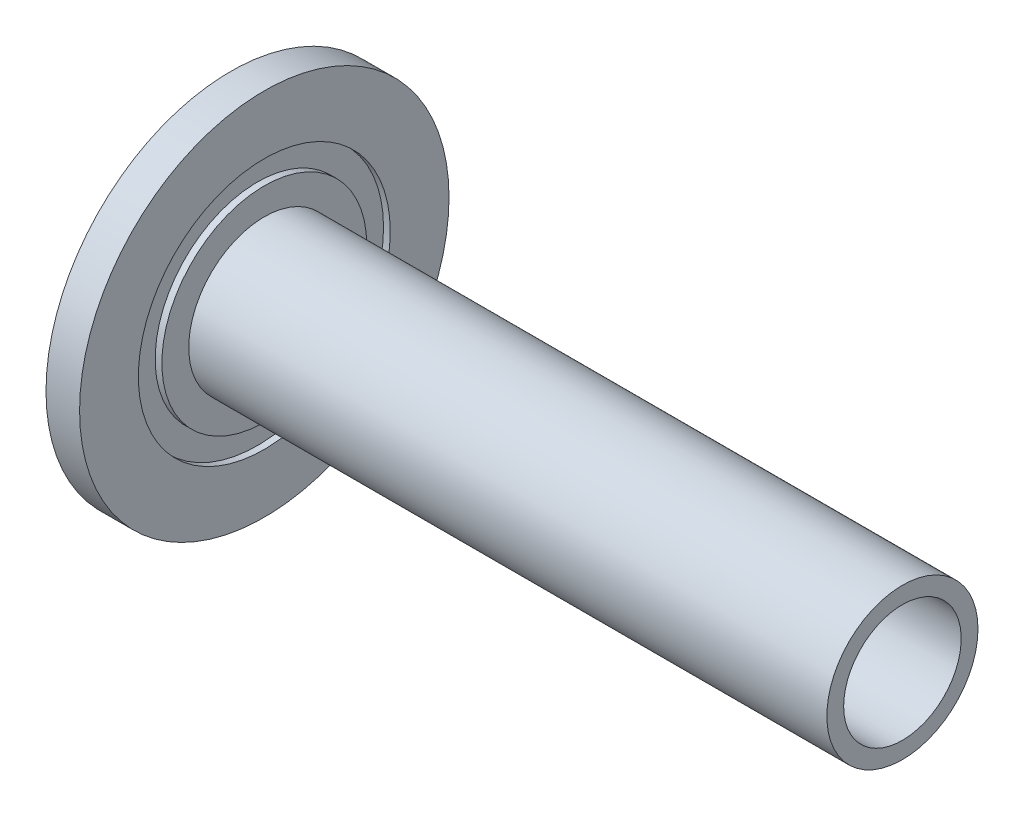
ISO-10303-21;
HEADER;
FILE_DESCRIPTION(('STEP AP214'),'2;1');
FILE_NAME('part.step','',(''),(''),'','','');
FILE_SCHEMA(('AUTOMOTIVE_DESIGN { 1 0 10303 214 1 1 1 1 }'));
ENDSEC;
DATA;
#1=APPLICATION_CONTEXT('core data for automotive mechanical design processes');
#2=APPLICATION_PROTOCOL_DEFINITION('international standard','automotive_design',2000,#1);
#3=PRODUCT_CONTEXT('',#1,'mechanical');
#4=PRODUCT('Part','Part','',(#3));
#5=PRODUCT_RELATED_PRODUCT_CATEGORY('part','',(#4));
#6=PRODUCT_DEFINITION_FORMATION('','',#4);
#7=PRODUCT_DEFINITION_CONTEXT('part definition',#1,'design');
#8=PRODUCT_DEFINITION('design','',#6,#7);
#9=PRODUCT_DEFINITION_SHAPE('','',#8);
#10=(LENGTH_UNIT() NAMED_UNIT(*) SI_UNIT(.MILLI.,.METRE.));
#11=(NAMED_UNIT(*) PLANE_ANGLE_UNIT() SI_UNIT($,.RADIAN.));
#12=(NAMED_UNIT(*) SI_UNIT($,.STERADIAN.) SOLID_ANGLE_UNIT());
#13=UNCERTAINTY_MEASURE_WITH_UNIT(LENGTH_MEASURE(1.E-05),#10,'distance_accuracy_value','');
#14=(GEOMETRIC_REPRESENTATION_CONTEXT(3) GLOBAL_UNCERTAINTY_ASSIGNED_CONTEXT((#13)) GLOBAL_UNIT_ASSIGNED_CONTEXT((#10,
#11,#12)) REPRESENTATION_CONTEXT('',''));
#15=CARTESIAN_POINT('',(0.,0.,0.));
#16=DIRECTION('',(0.,0.,1.));
#17=DIRECTION('',(1.,0.,0.));
#18=AXIS2_PLACEMENT_3D('',#15,#16,#17);
#19=CARTESIAN_POINT('',(1.,0.,0.));
#20=DIRECTION('',(-1.,0.,0.));
#21=DIRECTION('',(0.,0.,1.));
#22=AXIS2_PLACEMENT_3D('',#19,#20,#21);
#23=CYLINDRICAL_SURFACE('',#22,37.5);
#24=CARTESIAN_POINT('',(1.,0.,0.));
#25=DIRECTION('',(-1.,0.,0.));
#26=DIRECTION('',(0.,0.,1.));
#27=AXIS2_PLACEMENT_3D('',#24,#25,#26);
#28=CIRCLE('',#27,37.5);
#29=CARTESIAN_POINT('',(1.,-37.3125,3.74530956664458));
#30=VERTEX_POINT('',#29);
#31=CARTESIAN_POINT('',(1.,37.3125,3.74530956664458));
#32=VERTEX_POINT('',#31);
#33=EDGE_CURVE('E127',#30,#32,#28,.T.);
#34=ORIENTED_EDGE('',*,*,#33,.F.);
#35=DIRECTION('',(-1.,0.,0.));
#36=VECTOR('',#35,1.);
#37=CARTESIAN_POINT('',(1.,-37.3125,3.74530956664462));
#38=LINE('',#37,#36);
#39=CARTESIAN_POINT('',(0.,-37.3125,3.74530956664465));
#40=VERTEX_POINT('',#39);
#41=EDGE_CURVE('E124',#30,#40,#38,.T.);
#42=ORIENTED_EDGE('',*,*,#41,.T.);
#43=CARTESIAN_POINT('',(0.,0.,0.));
#44=DIRECTION('',(-1.,0.,0.));
#45=DIRECTION('',(0.,0.,1.));
#46=AXIS2_PLACEMENT_3D('',#43,#44,#45);
#47=CIRCLE('',#46,37.5);
#48=CARTESIAN_POINT('',(0.,37.3125,3.74530956664465));
#49=VERTEX_POINT('',#48);
#50=EDGE_CURVE('E118',#40,#49,#47,.T.);
#51=ORIENTED_EDGE('',*,*,#50,.T.);
#52=DIRECTION('',(-1.,0.,0.));
#53=VECTOR('',#52,1.);
#54=CARTESIAN_POINT('',(1.,37.3125,3.74530956664462));
#55=LINE('',#54,#53);
#56=EDGE_CURVE('E99',#49,#32,#55,.F.);
#57=ORIENTED_EDGE('',*,*,#56,.T.);
#58=EDGE_LOOP('',(#34,#42,#51,#57));
#59=FACE_BOUND('',#58,.T.);
#60=ADVANCED_FACE('F37',(#59),#23,.F.);
#61=CARTESIAN_POINT('',(1.,0.,0.));
#62=DIRECTION('',(-1.,0.,0.));
#63=DIRECTION('',(0.,0.,1.));
#64=AXIS2_PLACEMENT_3D('',#61,#62,#63);
#65=PLANE('',#64);
#66=CARTESIAN_POINT('',(1.,-34.,0.));
#67=DIRECTION('',(-1.,0.,0.));
#68=DIRECTION('',(0.,0.,1.));
#69=AXIS2_PLACEMENT_3D('',#66,#67,#68);
#70=CIRCLE('',#69,5.);
#71=CARTESIAN_POINT('',(1.,-30.3125,-3.37673566481002));
#72=VERTEX_POINT('',#71);
#73=CARTESIAN_POINT('',(1.,-37.3125,-3.74530956664458));
#74=VERTEX_POINT('',#73);
#75=EDGE_CURVE('E165',#72,#74,#70,.T.);
#76=ORIENTED_EDGE('',*,*,#75,.F.);
#77=CARTESIAN_POINT('',(1.,0.,0.));
#78=DIRECTION('',(-1.,0.,0.));
#79=DIRECTION('',(0.,0.,1.));
#80=AXIS2_PLACEMENT_3D('',#77,#78,#79);
#81=CIRCLE('',#80,30.5);
#82=CARTESIAN_POINT('',(1.,30.3125,-3.37673566481002));
#83=VERTEX_POINT('',#82);
#84=EDGE_CURVE('E125',#83,#72,#81,.T.);
#85=ORIENTED_EDGE('',*,*,#84,.F.);
#86=CARTESIAN_POINT('',(1.,34.,0.));
#87=DIRECTION('',(-1.,0.,0.));
#88=DIRECTION('',(0.,0.,1.));
#89=AXIS2_PLACEMENT_3D('',#86,#87,#88);
#90=CIRCLE('',#89,5.);
#91=CARTESIAN_POINT('',(1.,37.3125,-3.74530956664458));
#92=VERTEX_POINT('',#91);
#93=EDGE_CURVE('E110',#92,#83,#90,.T.);
#94=ORIENTED_EDGE('',*,*,#93,.F.);
#95=EDGE_CURVE('E138',#92,#74,#28,.T.);
#96=ORIENTED_EDGE('',*,*,#95,.T.);
#97=EDGE_LOOP('',(#76,#85,#94,#96));
#98=FACE_BOUND('',#97,.T.);
#99=ADVANCED_FACE('F173',(#98),#65,.T.);
#100=CARTESIAN_POINT('',(1.,0.,0.));
#101=DIRECTION('',(-1.,0.,0.));
#102=DIRECTION('',(0.,0.,1.));
#103=AXIS2_PLACEMENT_3D('',#100,#101,#102);
#104=CYLINDRICAL_SURFACE('',#103,30.5);
#105=DIRECTION('',(-1.,0.,0.));
#106=VECTOR('',#105,1.);
#107=CARTESIAN_POINT('',(1.,-30.3125,3.37673566481002));
#108=LINE('',#107,#106);
#109=CARTESIAN_POINT('',(1.,-30.3125,3.37673566481));
#110=VERTEX_POINT('',#109);
#111=CARTESIAN_POINT('',(0.,-30.3125,3.37673566481002));
#112=VERTEX_POINT('',#111);
#113=EDGE_CURVE('E11',#110,#112,#108,.T.);
#114=ORIENTED_EDGE('',*,*,#113,.F.);
#115=CARTESIAN_POINT('',(1.,30.3125,3.37673566481002));
#116=VERTEX_POINT('',#115);
#117=EDGE_CURVE('E129',#110,#116,#81,.T.);
#118=ORIENTED_EDGE('',*,*,#117,.T.);
#119=DIRECTION('',(-1.,0.,0.));
#120=VECTOR('',#119,1.);
#121=CARTESIAN_POINT('',(1.,30.3125,3.37673566481002));
#122=LINE('',#121,#120);
#123=CARTESIAN_POINT('',(0.,30.3125,3.37673566481002));
#124=VERTEX_POINT('',#123);
#125=EDGE_CURVE('E148',#124,#116,#122,.F.);
#126=ORIENTED_EDGE('',*,*,#125,.F.);
#127=CARTESIAN_POINT('',(0.,0.,0.));
#128=DIRECTION('',(-1.,0.,0.));
#129=DIRECTION('',(0.,0.,1.));
#130=AXIS2_PLACEMENT_3D('',#127,#128,#129);
#131=CIRCLE('',#130,30.5);
#132=EDGE_CURVE('E187',#112,#124,#131,.T.);
#133=ORIENTED_EDGE('',*,*,#132,.F.);
#134=EDGE_LOOP('',(#114,#118,#126,#133));
#135=FACE_BOUND('',#134,.T.);
#136=ADVANCED_FACE('F219',(#135),#104,.T.);
#137=CARTESIAN_POINT('',(10.,0.,0.));
#138=DIRECTION('',(1.,0.,0.));
#139=DIRECTION('',(0.,0.,-1.));
#140=AXIS2_PLACEMENT_3D('',#137,#138,#139);
#141=PLANE('',#140);
#142=CARTESIAN_POINT('',(10.,0.,0.));
#143=DIRECTION('',(1.,0.,0.));
#144=DIRECTION('',(0.,0.,-1.));
#145=AXIS2_PLACEMENT_3D('',#142,#143,#144);
#146=CIRCLE('',#145,22.5);
#147=CARTESIAN_POINT('',(10.,0.,-22.5));
#148=VERTEX_POINT('',#147);
#149=EDGE_CURVE('E145',#148,#148,#146,.T.);
#150=ORIENTED_EDGE('',*,*,#149,.F.);
#151=EDGE_LOOP('',(#150));
#152=FACE_BOUND('',#151,.T.);
#153=CARTESIAN_POINT('',(10.,0.,0.));
#154=DIRECTION('',(1.,0.,0.));
#155=DIRECTION('',(0.,0.,-1.));
#156=AXIS2_PLACEMENT_3D('',#153,#154,#155);
#157=CIRCLE('',#156,30.5);
#158=CARTESIAN_POINT('',(10.,0.,-30.5));
#159=VERTEX_POINT('',#158);
#160=EDGE_CURVE('E202',#159,#159,#157,.T.);
#161=ORIENTED_EDGE('',*,*,#160,.T.);
#162=EDGE_LOOP('',(#161));
#163=FACE_BOUND('',#162,.T.);
#164=ADVANCED_FACE('F273',(#152,#163),#141,.T.);
#165=CARTESIAN_POINT('',(0.,0.,0.));
#166=DIRECTION('',(1.,0.,0.));
#167=DIRECTION('',(0.,0.,-1.));
#168=AXIS2_PLACEMENT_3D('',#165,#166,#167);
#169=PLANE('',#168);
#170=CARTESIAN_POINT('',(0.,0.,0.));
#171=DIRECTION('',(1.,0.,0.));
#172=DIRECTION('',(0.,0.,-1.));
#173=AXIS2_PLACEMENT_3D('',#170,#171,#172);
#174=CIRCLE('',#173,17.5);
#175=CARTESIAN_POINT('',(0.,0.,-17.5));
#176=VERTEX_POINT('',#175);
#177=EDGE_CURVE('E137',#176,#176,#174,.T.);
#178=ORIENTED_EDGE('',*,*,#177,.T.);
#179=EDGE_LOOP('',(#178));
#180=FACE_BOUND('',#179,.T.);
#181=CARTESIAN_POINT('',(0.,30.3125,-3.37673566481002));
#182=VERTEX_POINT('',#181);
#183=CARTESIAN_POINT('',(0.,-30.3125,-3.37673566481002));
#184=VERTEX_POINT('',#183);
#185=EDGE_CURVE('E182',#182,#184,#131,.T.);
#186=ORIENTED_EDGE('',*,*,#185,.T.);
#187=CARTESIAN_POINT('',(0.,-34.,0.));
#188=DIRECTION('',(-1.,0.,0.));
#189=DIRECTION('',(0.,0.,1.));
#190=AXIS2_PLACEMENT_3D('',#187,#188,#189);
#191=CIRCLE('',#190,5.);
#192=EDGE_CURVE('E51',#112,#184,#191,.T.);
#193=ORIENTED_EDGE('',*,*,#192,.F.);
#194=ORIENTED_EDGE('',*,*,#132,.T.);
#195=CARTESIAN_POINT('',(0.,34.,0.));
#196=DIRECTION('',(-1.,0.,0.));
#197=DIRECTION('',(0.,0.,1.));
#198=AXIS2_PLACEMENT_3D('',#195,#196,#197);
#199=CIRCLE('',#198,5.);
#200=EDGE_CURVE('E59',#182,#124,#199,.T.);
#201=ORIENTED_EDGE('',*,*,#200,.F.);
#202=EDGE_LOOP('',(#186,#193,#194,#201));
#203=FACE_BOUND('',#202,.T.);
#204=ADVANCED_FACE('F185',(#180,#203),#169,.F.);
#205=CARTESIAN_POINT('',(10.,0.,0.));
#206=DIRECTION('',(-1.,0.,0.));
#207=DIRECTION('',(0.,0.,1.));
#208=AXIS2_PLACEMENT_3D('',#205,#206,#207);
#209=CYLINDRICAL_SURFACE('',#208,55.);
#210=CARTESIAN_POINT('',(10.,0.,0.));
#211=DIRECTION('',(1.,0.,0.));
#212=DIRECTION('',(0.,0.,-1.));
#213=AXIS2_PLACEMENT_3D('',#210,#211,#212);
#214=CIRCLE('',#213,55.);
#215=CARTESIAN_POINT('',(10.,0.,-55.));
#216=VERTEX_POINT('',#215);
#217=EDGE_CURVE('E149',#216,#216,#214,.T.);
#218=ORIENTED_EDGE('',*,*,#217,.F.);
#219=EDGE_LOOP('',(#218));
#220=FACE_BOUND('',#219,.T.);
#221=CARTESIAN_POINT('',(0.,0.,0.));
#222=DIRECTION('',(1.,0.,0.));
#223=DIRECTION('',(0.,0.,-1.));
#224=AXIS2_PLACEMENT_3D('',#221,#222,#223);
#225=CIRCLE('',#224,55.);
#226=CARTESIAN_POINT('',(0.,0.,-55.));
#227=VERTEX_POINT('',#226);
#228=EDGE_CURVE('E144',#227,#227,#225,.T.);
#229=ORIENTED_EDGE('',*,*,#228,.T.);
#230=EDGE_LOOP('',(#229));
#231=FACE_BOUND('',#230,.T.);
#232=ADVANCED_FACE('F39',(#220,#231),#209,.T.);
#233=CARTESIAN_POINT('',(10.,0.,0.));
#234=DIRECTION('',(1.,0.,0.));
#235=DIRECTION('',(0.,0.,-1.));
#236=AXIS2_PLACEMENT_3D('',#233,#234,#235);
#237=CIRCLE('',#236,37.5);
#238=CARTESIAN_POINT('',(10.,0.,-37.5));
#239=VERTEX_POINT('',#238);
#240=EDGE_CURVE('E208',#239,#239,#237,.T.);
#241=ORIENTED_EDGE('',*,*,#240,.F.);
#242=EDGE_LOOP('',(#241));
#243=FACE_BOUND('',#242,.T.);
#244=ORIENTED_EDGE('',*,*,#217,.T.);
#245=EDGE_LOOP('',(#244));
#246=FACE_BOUND('',#245,.T.);
#247=ADVANCED_FACE('F270',(#243,#246),#141,.T.);
#248=ORIENTED_EDGE('',*,*,#50,.F.);
#249=CARTESIAN_POINT('',(0.,-37.3125,-3.74530956664465));
#250=VERTEX_POINT('',#249);
#251=EDGE_CURVE('E121',#250,#40,#191,.T.);
#252=ORIENTED_EDGE('',*,*,#251,.F.);
#253=CARTESIAN_POINT('',(0.,37.3125,-3.74530956664465));
#254=VERTEX_POINT('',#253);
#255=EDGE_CURVE('E120',#254,#250,#47,.T.);
#256=ORIENTED_EDGE('',*,*,#255,.F.);
#257=EDGE_CURVE('E102',#49,#254,#199,.T.);
#258=ORIENTED_EDGE('',*,*,#257,.F.);
#259=EDGE_LOOP('',(#248,#252,#256,#258));
#260=FACE_BOUND('',#259,.T.);
#261=ORIENTED_EDGE('',*,*,#228,.F.);
#262=EDGE_LOOP('',(#261));
#263=FACE_BOUND('',#262,.T.);
#264=ADVANCED_FACE('F115',(#260,#263),#169,.F.);
#265=CARTESIAN_POINT('',(200.,0.,0.));
#266=DIRECTION('',(-1.,0.,0.));
#267=DIRECTION('',(0.,0.,1.));
#268=AXIS2_PLACEMENT_3D('',#265,#266,#267);
#269=CYLINDRICAL_SURFACE('',#268,22.5);
#270=CARTESIAN_POINT('',(200.,0.,0.));
#271=DIRECTION('',(1.,0.,0.));
#272=DIRECTION('',(0.,0.,-1.));
#273=AXIS2_PLACEMENT_3D('',#270,#271,#272);
#274=CIRCLE('',#273,22.5);
#275=CARTESIAN_POINT('',(200.,0.,-22.5));
#276=VERTEX_POINT('',#275);
#277=EDGE_CURVE('E141',#276,#276,#274,.T.);
#278=ORIENTED_EDGE('',*,*,#277,.F.);
#279=EDGE_LOOP('',(#278));
#280=FACE_BOUND('',#279,.T.);
#281=ORIENTED_EDGE('',*,*,#149,.T.);
#282=EDGE_LOOP('',(#281));
#283=FACE_BOUND('',#282,.T.);
#284=ADVANCED_FACE('F261',(#280,#283),#269,.T.);
#285=CARTESIAN_POINT('',(200.,0.,0.));
#286=DIRECTION('',(1.,0.,0.));
#287=DIRECTION('',(0.,0.,-1.));
#288=AXIS2_PLACEMENT_3D('',#285,#286,#287);
#289=PLANE('',#288);
#290=CARTESIAN_POINT('',(200.,0.,0.));
#291=DIRECTION('',(-1.,0.,0.));
#292=DIRECTION('',(0.,0.,1.));
#293=AXIS2_PLACEMENT_3D('',#290,#291,#292);
#294=CIRCLE('',#293,17.5);
#295=CARTESIAN_POINT('',(200.,0.,17.5));
#296=VERTEX_POINT('',#295);
#297=EDGE_CURVE('E134',#296,#296,#294,.T.);
#298=ORIENTED_EDGE('',*,*,#297,.T.);
#299=EDGE_LOOP('',(#298));
#300=FACE_BOUND('',#299,.T.);
#301=ORIENTED_EDGE('',*,*,#277,.T.);
#302=EDGE_LOOP('',(#301));
#303=FACE_BOUND('',#302,.T.);
#304=ADVANCED_FACE('F256',(#300,#303),#289,.T.);
#305=CARTESIAN_POINT('',(200.,0.,0.));
#306=DIRECTION('',(-1.,0.,0.));
#307=DIRECTION('',(0.,0.,1.));
#308=AXIS2_PLACEMENT_3D('',#305,#306,#307);
#309=CYLINDRICAL_SURFACE('',#308,17.5);
#310=ORIENTED_EDGE('',*,*,#297,.F.);
#311=EDGE_LOOP('',(#310));
#312=FACE_BOUND('',#311,.T.);
#313=ORIENTED_EDGE('',*,*,#177,.F.);
#314=EDGE_LOOP('',(#313));
#315=FACE_BOUND('',#314,.T.);
#316=ADVANCED_FACE('F250',(#312,#315),#309,.F.);
#317=ORIENTED_EDGE('',*,*,#255,.T.);
#318=DIRECTION('',(-1.,0.,0.));
#319=VECTOR('',#318,1.);
#320=CARTESIAN_POINT('',(1.,-37.3125,-3.74530956664462));
#321=LINE('',#320,#319);
#322=EDGE_CURVE('E176',#250,#74,#321,.F.);
#323=ORIENTED_EDGE('',*,*,#322,.T.);
#324=ORIENTED_EDGE('',*,*,#95,.F.);
#325=DIRECTION('',(-1.,0.,0.));
#326=VECTOR('',#325,1.);
#327=CARTESIAN_POINT('',(1.,37.3125,-3.74530956664462));
#328=LINE('',#327,#326);
#329=EDGE_CURVE('E177',#92,#254,#328,.T.);
#330=ORIENTED_EDGE('',*,*,#329,.T.);
#331=EDGE_LOOP('',(#317,#323,#324,#330));
#332=FACE_BOUND('',#331,.T.);
#333=ADVANCED_FACE('F243',(#332),#23,.F.);
#334=EDGE_CURVE('E179',#30,#110,#70,.T.);
#335=ORIENTED_EDGE('',*,*,#334,.F.);
#336=ORIENTED_EDGE('',*,*,#33,.T.);
#337=EDGE_CURVE('E105',#116,#32,#90,.T.);
#338=ORIENTED_EDGE('',*,*,#337,.F.);
#339=ORIENTED_EDGE('',*,*,#117,.F.);
#340=EDGE_LOOP('',(#335,#336,#338,#339));
#341=FACE_BOUND('',#340,.T.);
#342=ADVANCED_FACE('F222',(#341),#65,.T.);
#343=DIRECTION('',(-1.,0.,0.));
#344=VECTOR('',#343,1.);
#345=CARTESIAN_POINT('',(1.,-30.3125,-3.37673566481002));
#346=LINE('',#345,#344);
#347=EDGE_CURVE('E45',#184,#72,#346,.F.);
#348=ORIENTED_EDGE('',*,*,#347,.F.);
#349=ORIENTED_EDGE('',*,*,#185,.F.);
#350=DIRECTION('',(-1.,0.,0.));
#351=VECTOR('',#350,1.);
#352=CARTESIAN_POINT('',(1.,30.3125,-3.37673566481002));
#353=LINE('',#352,#351);
#354=EDGE_CURVE('E162',#83,#182,#353,.T.);
#355=ORIENTED_EDGE('',*,*,#354,.F.);
#356=ORIENTED_EDGE('',*,*,#84,.T.);
#357=EDGE_LOOP('',(#348,#349,#355,#356));
#358=FACE_BOUND('',#357,.T.);
#359=ADVANCED_FACE('F181',(#358),#104,.T.);
#360=CARTESIAN_POINT('',(8.,0.,0.));
#361=DIRECTION('',(1.,0.,0.));
#362=DIRECTION('',(0.,0.,-1.));
#363=AXIS2_PLACEMENT_3D('',#360,#361,#362);
#364=CYLINDRICAL_SURFACE('',#363,37.5);
#365=CARTESIAN_POINT('',(8.,0.,0.));
#366=DIRECTION('',(1.,0.,0.));
#367=DIRECTION('',(0.,0.,-1.));
#368=AXIS2_PLACEMENT_3D('',#365,#366,#367);
#369=CIRCLE('',#368,37.5);
#370=CARTESIAN_POINT('',(8.,0.,-37.5));
#371=VERTEX_POINT('',#370);
#372=EDGE_CURVE('E211',#371,#371,#369,.T.);
#373=ORIENTED_EDGE('',*,*,#372,.F.);
#374=EDGE_LOOP('',(#373));
#375=FACE_BOUND('',#374,.T.);
#376=ORIENTED_EDGE('',*,*,#240,.T.);
#377=EDGE_LOOP('',(#376));
#378=FACE_BOUND('',#377,.T.);
#379=ADVANCED_FACE('F304',(#375,#378),#364,.F.);
#380=CARTESIAN_POINT('',(8.,0.,0.));
#381=DIRECTION('',(1.,0.,0.));
#382=DIRECTION('',(0.,0.,-1.));
#383=AXIS2_PLACEMENT_3D('',#380,#381,#382);
#384=PLANE('',#383);
#385=CARTESIAN_POINT('',(8.,0.,0.));
#386=DIRECTION('',(1.,0.,0.));
#387=DIRECTION('',(0.,0.,-1.));
#388=AXIS2_PLACEMENT_3D('',#385,#386,#387);
#389=CIRCLE('',#388,30.5);
#390=CARTESIAN_POINT('',(8.,0.,-30.5));
#391=VERTEX_POINT('',#390);
#392=EDGE_CURVE('E205',#391,#391,#389,.T.);
#393=ORIENTED_EDGE('',*,*,#392,.F.);
#394=EDGE_LOOP('',(#393));
#395=FACE_BOUND('',#394,.T.);
#396=ORIENTED_EDGE('',*,*,#372,.T.);
#397=EDGE_LOOP('',(#396));
#398=FACE_BOUND('',#397,.T.);
#399=ADVANCED_FACE('F296',(#395,#398),#384,.T.);
#400=CARTESIAN_POINT('',(8.,0.,0.));
#401=DIRECTION('',(1.,0.,0.));
#402=DIRECTION('',(0.,0.,-1.));
#403=AXIS2_PLACEMENT_3D('',#400,#401,#402);
#404=CYLINDRICAL_SURFACE('',#403,30.5);
#405=ORIENTED_EDGE('',*,*,#392,.T.);
#406=EDGE_LOOP('',(#405));
#407=FACE_BOUND('',#406,.T.);
#408=ORIENTED_EDGE('',*,*,#160,.F.);
#409=EDGE_LOOP('',(#408));
#410=FACE_BOUND('',#409,.T.);
#411=ADVANCED_FACE('F294',(#407,#410),#404,.T.);
#412=CARTESIAN_POINT('',(2.,34.,0.));
#413=DIRECTION('',(-1.,0.,0.));
#414=DIRECTION('',(0.,0.,1.));
#415=AXIS2_PLACEMENT_3D('',#412,#413,#414);
#416=CYLINDRICAL_SURFACE('',#415,5.);
#417=CARTESIAN_POINT('',(2.,34.,0.));
#418=DIRECTION('',(-1.,0.,0.));
#419=DIRECTION('',(0.,0.,1.));
#420=AXIS2_PLACEMENT_3D('',#417,#418,#419);
#421=CIRCLE('',#420,5.);
#422=CARTESIAN_POINT('',(2.,34.,5.));
#423=VERTEX_POINT('',#422);
#424=EDGE_CURVE('E188',#423,#423,#421,.T.);
#425=ORIENTED_EDGE('',*,*,#424,.F.);
#426=EDGE_LOOP('',(#425));
#427=FACE_BOUND('',#426,.T.);
#428=ORIENTED_EDGE('',*,*,#93,.T.);
#429=ORIENTED_EDGE('',*,*,#354,.T.);
#430=ORIENTED_EDGE('',*,*,#200,.T.);
#431=ORIENTED_EDGE('',*,*,#125,.T.);
#432=ORIENTED_EDGE('',*,*,#337,.T.);
#433=ORIENTED_EDGE('',*,*,#56,.F.);
#434=ORIENTED_EDGE('',*,*,#257,.T.);
#435=ORIENTED_EDGE('',*,*,#329,.F.);
#436=EDGE_LOOP('',(#428,#429,#430,#431,#432,#433,#434,#435));
#437=FACE_BOUND('',#436,.T.);
#438=ADVANCED_FACE('F101',(#427,#437),#416,.F.);
#439=CARTESIAN_POINT('',(2.,34.,0.));
#440=DIRECTION('',(-1.,0.,0.));
#441=DIRECTION('',(0.,0.,1.));
#442=AXIS2_PLACEMENT_3D('',#439,#440,#441);
#443=PLANE('',#442);
#444=ORIENTED_EDGE('',*,*,#424,.T.);
#445=EDGE_LOOP('',(#444));
#446=FACE_BOUND('',#445,.T.);
#447=CARTESIAN_POINT('',(2.,34.,0.));
#448=DIRECTION('',(-1.,0.,0.));
#449=DIRECTION('',(0.,0.,1.));
#450=AXIS2_PLACEMENT_3D('',#447,#448,#449);
#451=CIRCLE('',#450,2.5);
#452=CARTESIAN_POINT('',(2.,34.,2.5));
#453=VERTEX_POINT('',#452);
#454=EDGE_CURVE('E154',#453,#453,#451,.F.);
#455=ORIENTED_EDGE('',*,*,#454,.T.);
#456=EDGE_LOOP('',(#455));
#457=FACE_BOUND('',#456,.T.);
#458=ADVANCED_FACE('F230',(#446,#457),#443,.T.);
#459=CARTESIAN_POINT('',(2.,-34.,0.));
#460=DIRECTION('',(-1.,0.,0.));
#461=DIRECTION('',(0.,0.,1.));
#462=AXIS2_PLACEMENT_3D('',#459,#460,#461);
#463=CYLINDRICAL_SURFACE('',#462,5.);
#464=CARTESIAN_POINT('',(2.,-34.,0.));
#465=DIRECTION('',(-1.,0.,0.));
#466=DIRECTION('',(0.,0.,1.));
#467=AXIS2_PLACEMENT_3D('',#464,#465,#466);
#468=CIRCLE('',#467,5.);
#469=CARTESIAN_POINT('',(2.,-34.,5.));
#470=VERTEX_POINT('',#469);
#471=EDGE_CURVE('E158',#470,#470,#468,.T.);
#472=ORIENTED_EDGE('',*,*,#471,.F.);
#473=EDGE_LOOP('',(#472));
#474=FACE_BOUND('',#473,.T.);
#475=ORIENTED_EDGE('',*,*,#334,.T.);
#476=ORIENTED_EDGE('',*,*,#113,.T.);
#477=ORIENTED_EDGE('',*,*,#192,.T.);
#478=ORIENTED_EDGE('',*,*,#347,.T.);
#479=ORIENTED_EDGE('',*,*,#75,.T.);
#480=ORIENTED_EDGE('',*,*,#322,.F.);
#481=ORIENTED_EDGE('',*,*,#251,.T.);
#482=ORIENTED_EDGE('',*,*,#41,.F.);
#483=EDGE_LOOP('',(#475,#476,#477,#478,#479,#480,#481,#482));
#484=FACE_BOUND('',#483,.T.);
#485=ADVANCED_FACE('F164',(#474,#484),#463,.F.);
#486=CARTESIAN_POINT('',(2.,-34.,0.));
#487=DIRECTION('',(-1.,0.,0.));
#488=DIRECTION('',(0.,0.,1.));
#489=AXIS2_PLACEMENT_3D('',#486,#487,#488);
#490=PLANE('',#489);
#491=ORIENTED_EDGE('',*,*,#471,.T.);
#492=EDGE_LOOP('',(#491));
#493=FACE_BOUND('',#492,.T.);
#494=CARTESIAN_POINT('',(2.,-34.,0.));
#495=DIRECTION('',(-1.,0.,0.));
#496=DIRECTION('',(0.,0.,1.));
#497=AXIS2_PLACEMENT_3D('',#494,#495,#496);
#498=CIRCLE('',#497,2.5);
#499=CARTESIAN_POINT('',(2.,-34.,2.5));
#500=VERTEX_POINT('',#499);
#501=EDGE_CURVE('E157',#500,#500,#498,.F.);
#502=ORIENTED_EDGE('',*,*,#501,.T.);
#503=EDGE_LOOP('',(#502));
#504=FACE_BOUND('',#503,.T.);
#505=ADVANCED_FACE('F226',(#493,#504),#490,.T.);
#506=CARTESIAN_POINT('',(4.,34.,0.));
#507=DIRECTION('',(-1.,0.,0.));
#508=DIRECTION('',(0.,0.,1.));
#509=AXIS2_PLACEMENT_3D('',#506,#507,#508);
#510=PLANE('',#509);
#511=CARTESIAN_POINT('',(4.,34.,0.));
#512=DIRECTION('',(-1.,0.,0.));
#513=DIRECTION('',(0.,0.,1.));
#514=AXIS2_PLACEMENT_3D('',#511,#512,#513);
#515=CIRCLE('',#514,2.5);
#516=CARTESIAN_POINT('',(4.,34.,2.5));
#517=VERTEX_POINT('',#516);
#518=EDGE_CURVE('E199',#517,#517,#515,.T.);
#519=ORIENTED_EDGE('',*,*,#518,.T.);
#520=EDGE_LOOP('',(#519));
#521=FACE_BOUND('',#520,.T.);
#522=ADVANCED_FACE('F236',(#521),#510,.T.);
#523=CARTESIAN_POINT('',(4.,34.,0.));
#524=DIRECTION('',(-1.,0.,0.));
#525=DIRECTION('',(0.,0.,1.));
#526=AXIS2_PLACEMENT_3D('',#523,#524,#525);
#527=CYLINDRICAL_SURFACE('',#526,2.5);
#528=ORIENTED_EDGE('',*,*,#518,.F.);
#529=EDGE_LOOP('',(#528));
#530=FACE_BOUND('',#529,.T.);
#531=ORIENTED_EDGE('',*,*,#454,.F.);
#532=EDGE_LOOP('',(#531));
#533=FACE_BOUND('',#532,.T.);
#534=ADVANCED_FACE('F344',(#530,#533),#527,.F.);
#535=CARTESIAN_POINT('',(4.,-34.,0.));
#536=DIRECTION('',(-1.,0.,0.));
#537=DIRECTION('',(0.,0.,1.));
#538=AXIS2_PLACEMENT_3D('',#535,#536,#537);
#539=PLANE('',#538);
#540=CARTESIAN_POINT('',(4.,-34.,0.));
#541=DIRECTION('',(-1.,0.,0.));
#542=DIRECTION('',(0.,0.,1.));
#543=AXIS2_PLACEMENT_3D('',#540,#541,#542);
#544=CIRCLE('',#543,2.5);
#545=CARTESIAN_POINT('',(4.,-34.,2.5));
#546=VERTEX_POINT('',#545);
#547=EDGE_CURVE('E198',#546,#546,#544,.T.);
#548=ORIENTED_EDGE('',*,*,#547,.T.);
#549=EDGE_LOOP('',(#548));
#550=FACE_BOUND('',#549,.T.);
#551=ADVANCED_FACE('F308',(#550),#539,.T.);
#552=CARTESIAN_POINT('',(4.,-34.,0.));
#553=DIRECTION('',(-1.,0.,0.));
#554=DIRECTION('',(0.,0.,1.));
#555=AXIS2_PLACEMENT_3D('',#552,#553,#554);
#556=CYLINDRICAL_SURFACE('',#555,2.5);
#557=ORIENTED_EDGE('',*,*,#547,.F.);
#558=EDGE_LOOP('',(#557));
#559=FACE_BOUND('',#558,.T.);
#560=ORIENTED_EDGE('',*,*,#501,.F.);
#561=EDGE_LOOP('',(#560));
#562=FACE_BOUND('',#561,.T.);
#563=ADVANCED_FACE('F343',(#559,#562),#556,.F.);
#564=CLOSED_SHELL('',(#60,#99,#136,#164,#204,#232,#247,#264,#284,#304,#316,#333,#342,#359,#379,
#399,#411,#438,#458,#485,#505,#522,#534,#551,#563));
#565=MANIFOLD_SOLID_BREP('B2',#564);
#566=ADVANCED_BREP_SHAPE_REPRESENTATION('',(#18,#565),#14);
#567=SHAPE_DEFINITION_REPRESENTATION(#9,#566);
ENDSEC;
END-ISO-10303-21;
